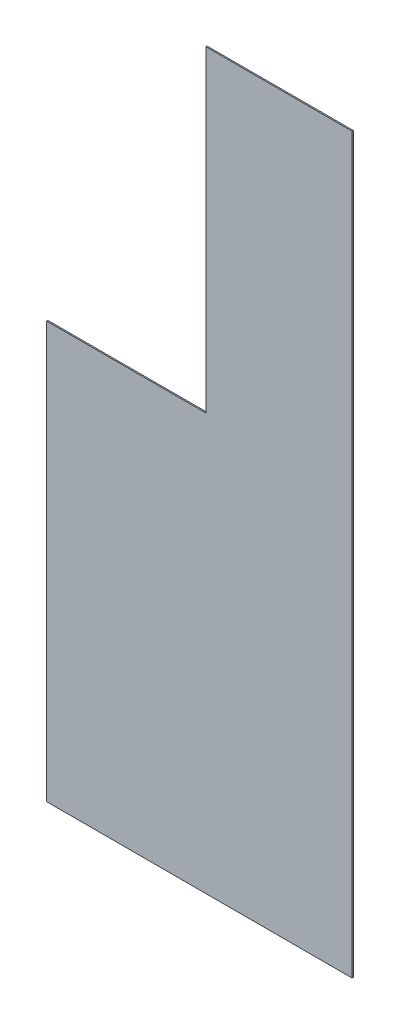
ISO-10303-21;
HEADER;
FILE_DESCRIPTION(('STEP AP214'),'2;1');
FILE_NAME('part.step','',(''),(''),'','','');
FILE_SCHEMA(('AUTOMOTIVE_DESIGN { 1 0 10303 214 1 1 1 1 }'));
ENDSEC;
DATA;
#1=APPLICATION_CONTEXT('core data for automotive mechanical design processes');
#2=APPLICATION_PROTOCOL_DEFINITION('international standard','automotive_design',2000,#1);
#3=PRODUCT_CONTEXT('',#1,'mechanical');
#4=PRODUCT('Part','Part','',(#3));
#5=PRODUCT_RELATED_PRODUCT_CATEGORY('part','',(#4));
#6=PRODUCT_DEFINITION_FORMATION('','',#4);
#7=PRODUCT_DEFINITION_CONTEXT('part definition',#1,'design');
#8=PRODUCT_DEFINITION('design','',#6,#7);
#9=PRODUCT_DEFINITION_SHAPE('','',#8);
#10=(LENGTH_UNIT() NAMED_UNIT(*) SI_UNIT(.MILLI.,.METRE.));
#11=(NAMED_UNIT(*) PLANE_ANGLE_UNIT() SI_UNIT($,.RADIAN.));
#12=(NAMED_UNIT(*) SI_UNIT($,.STERADIAN.) SOLID_ANGLE_UNIT());
#13=UNCERTAINTY_MEASURE_WITH_UNIT(LENGTH_MEASURE(1.E-05),#10,'distance_accuracy_value','');
#14=(GEOMETRIC_REPRESENTATION_CONTEXT(3) GLOBAL_UNCERTAINTY_ASSIGNED_CONTEXT((#13)) GLOBAL_UNIT_ASSIGNED_CONTEXT((#10,
#11,#12)) REPRESENTATION_CONTEXT('',''));
#15=CARTESIAN_POINT('',(0.,0.,0.));
#16=DIRECTION('',(0.,0.,1.));
#17=DIRECTION('',(1.,0.,0.));
#18=AXIS2_PLACEMENT_3D('',#15,#16,#17);
#19=CARTESIAN_POINT('',(2505.,0.,-10.));
#20=DIRECTION('',(0.,-1.,0.));
#21=DIRECTION('',(1.,0.,0.));
#22=AXIS2_PLACEMENT_3D('',#19,#20,#21);
#23=PLANE('',#22);
#24=DIRECTION('',(1.,0.,0.));
#25=VECTOR('',#24,1.);
#26=CARTESIAN_POINT('',(2505.,0.,0.));
#27=LINE('',#26,#25);
#28=CARTESIAN_POINT('',(0.,0.,0.));
#29=VERTEX_POINT('',#28);
#30=CARTESIAN_POINT('',(2505.,0.,0.));
#31=VERTEX_POINT('',#30);
#32=EDGE_CURVE('E123',#29,#31,#27,.T.);
#33=ORIENTED_EDGE('',*,*,#32,.F.);
#34=DIRECTION('',(0.,0.,1.));
#35=VECTOR('',#34,1.);
#36=CARTESIAN_POINT('',(0.,0.,-10.));
#37=LINE('',#36,#35);
#38=CARTESIAN_POINT('',(0.,0.,-10.));
#39=VERTEX_POINT('',#38);
#40=EDGE_CURVE('E11',#39,#29,#37,.T.);
#41=ORIENTED_EDGE('',*,*,#40,.F.);
#42=DIRECTION('',(1.,0.,0.));
#43=VECTOR('',#42,1.);
#44=CARTESIAN_POINT('',(2505.,0.,-10.));
#45=LINE('',#44,#43);
#46=CARTESIAN_POINT('',(2505.,0.,-10.));
#47=VERTEX_POINT('',#46);
#48=EDGE_CURVE('E137',#39,#47,#45,.T.);
#49=ORIENTED_EDGE('',*,*,#48,.T.);
#50=DIRECTION('',(0.,0.,1.));
#51=VECTOR('',#50,1.);
#52=CARTESIAN_POINT('',(2505.,0.,-10.));
#53=LINE('',#52,#51);
#54=EDGE_CURVE('E41',#47,#31,#53,.T.);
#55=ORIENTED_EDGE('',*,*,#54,.T.);
#56=EDGE_LOOP('',(#33,#41,#49,#55));
#57=FACE_BOUND('',#56,.T.);
#58=ADVANCED_FACE('F38',(#57),#23,.T.);
#59=CARTESIAN_POINT('',(0.,0.,-10.));
#60=DIRECTION('',(-1.,0.,0.));
#61=DIRECTION('',(0.,0.,1.));
#62=AXIS2_PLACEMENT_3D('',#59,#60,#61);
#63=PLANE('',#62);
#64=DIRECTION('',(0.,-1.,0.));
#65=VECTOR('',#64,1.);
#66=CARTESIAN_POINT('',(0.,0.,0.));
#67=LINE('',#66,#65);
#68=CARTESIAN_POINT('',(0.,3415.,0.));
#69=VERTEX_POINT('',#68);
#70=EDGE_CURVE('E135',#69,#29,#67,.T.);
#71=ORIENTED_EDGE('',*,*,#70,.F.);
#72=DIRECTION('',(0.,0.,1.));
#73=VECTOR('',#72,1.);
#74=CARTESIAN_POINT('',(0.,3415.,-10.));
#75=LINE('',#74,#73);
#76=CARTESIAN_POINT('',(0.,3415.,-10.));
#77=VERTEX_POINT('',#76);
#78=EDGE_CURVE('E47',#77,#69,#75,.T.);
#79=ORIENTED_EDGE('',*,*,#78,.F.);
#80=DIRECTION('',(0.,-1.,0.));
#81=VECTOR('',#80,1.);
#82=CARTESIAN_POINT('',(0.,0.,-10.));
#83=LINE('',#82,#81);
#84=EDGE_CURVE('E113',#77,#39,#83,.T.);
#85=ORIENTED_EDGE('',*,*,#84,.T.);
#86=ORIENTED_EDGE('',*,*,#40,.T.);
#87=EDGE_LOOP('',(#71,#79,#85,#86));
#88=FACE_BOUND('',#87,.T.);
#89=ADVANCED_FACE('F145',(#88),#63,.T.);
#90=CARTESIAN_POINT('',(0.,3415.,-10.));
#91=DIRECTION('',(0.,1.,0.));
#92=DIRECTION('',(0.,0.,1.));
#93=AXIS2_PLACEMENT_3D('',#90,#91,#92);
#94=PLANE('',#93);
#95=DIRECTION('',(-1.,0.,0.));
#96=VECTOR('',#95,1.);
#97=CARTESIAN_POINT('',(0.,3415.,0.));
#98=LINE('',#97,#96);
#99=CARTESIAN_POINT('',(1305.,3415.,0.));
#100=VERTEX_POINT('',#99);
#101=EDGE_CURVE('E100',#100,#69,#98,.T.);
#102=ORIENTED_EDGE('',*,*,#101,.F.);
#103=DIRECTION('',(0.,0.,1.));
#104=VECTOR('',#103,1.);
#105=CARTESIAN_POINT('',(1305.,3415.,-10.));
#106=LINE('',#105,#104);
#107=CARTESIAN_POINT('',(1305.,3415.,-10.));
#108=VERTEX_POINT('',#107);
#109=EDGE_CURVE('E95',#108,#100,#106,.T.);
#110=ORIENTED_EDGE('',*,*,#109,.F.);
#111=DIRECTION('',(-1.,0.,0.));
#112=VECTOR('',#111,1.);
#113=CARTESIAN_POINT('',(0.,3415.,-10.));
#114=LINE('',#113,#112);
#115=EDGE_CURVE('E98',#108,#77,#114,.T.);
#116=ORIENTED_EDGE('',*,*,#115,.T.);
#117=ORIENTED_EDGE('',*,*,#78,.T.);
#118=EDGE_LOOP('',(#102,#110,#116,#117));
#119=FACE_BOUND('',#118,.T.);
#120=ADVANCED_FACE('F97',(#119),#94,.T.);
#121=CARTESIAN_POINT('',(1305.,3415.,-10.));
#122=DIRECTION('',(-1.,0.,0.));
#123=DIRECTION('',(0.,0.,1.));
#124=AXIS2_PLACEMENT_3D('',#121,#122,#123);
#125=PLANE('',#124);
#126=DIRECTION('',(0.,-1.,0.));
#127=VECTOR('',#126,1.);
#128=CARTESIAN_POINT('',(1305.,3415.,0.));
#129=LINE('',#128,#127);
#130=CARTESIAN_POINT('',(1305.,6017.,0.));
#131=VERTEX_POINT('',#130);
#132=EDGE_CURVE('E132',#131,#100,#129,.T.);
#133=ORIENTED_EDGE('',*,*,#132,.F.);
#134=DIRECTION('',(0.,0.,1.));
#135=VECTOR('',#134,1.);
#136=CARTESIAN_POINT('',(1305.,6017.,-10.));
#137=LINE('',#136,#135);
#138=CARTESIAN_POINT('',(1305.,6017.,-10.));
#139=VERTEX_POINT('',#138);
#140=EDGE_CURVE('E105',#139,#131,#137,.T.);
#141=ORIENTED_EDGE('',*,*,#140,.F.);
#142=DIRECTION('',(0.,-1.,0.));
#143=VECTOR('',#142,1.);
#144=CARTESIAN_POINT('',(1305.,3415.,-10.));
#145=LINE('',#144,#143);
#146=EDGE_CURVE('E111',#139,#108,#145,.T.);
#147=ORIENTED_EDGE('',*,*,#146,.T.);
#148=ORIENTED_EDGE('',*,*,#109,.T.);
#149=EDGE_LOOP('',(#133,#141,#147,#148));
#150=FACE_BOUND('',#149,.T.);
#151=ADVANCED_FACE('F115',(#150),#125,.T.);
#152=CARTESIAN_POINT('',(1305.,6017.,-10.));
#153=DIRECTION('',(0.,1.,0.));
#154=DIRECTION('',(0.,0.,1.));
#155=AXIS2_PLACEMENT_3D('',#152,#153,#154);
#156=PLANE('',#155);
#157=DIRECTION('',(-1.,0.,0.));
#158=VECTOR('',#157,1.);
#159=CARTESIAN_POINT('',(1305.,6017.,0.));
#160=LINE('',#159,#158);
#161=CARTESIAN_POINT('',(2505.,6017.,0.));
#162=VERTEX_POINT('',#161);
#163=EDGE_CURVE('E129',#162,#131,#160,.T.);
#164=ORIENTED_EDGE('',*,*,#163,.F.);
#165=DIRECTION('',(0.,0.,1.));
#166=VECTOR('',#165,1.);
#167=CARTESIAN_POINT('',(2505.,6017.,-10.));
#168=LINE('',#167,#166);
#169=CARTESIAN_POINT('',(2505.,6017.,-10.));
#170=VERTEX_POINT('',#169);
#171=EDGE_CURVE('E140',#170,#162,#168,.T.);
#172=ORIENTED_EDGE('',*,*,#171,.F.);
#173=DIRECTION('',(-1.,0.,0.));
#174=VECTOR('',#173,1.);
#175=CARTESIAN_POINT('',(1305.,6017.,-10.));
#176=LINE('',#175,#174);
#177=EDGE_CURVE('E116',#170,#139,#176,.T.);
#178=ORIENTED_EDGE('',*,*,#177,.T.);
#179=ORIENTED_EDGE('',*,*,#140,.T.);
#180=EDGE_LOOP('',(#164,#172,#178,#179));
#181=FACE_BOUND('',#180,.T.);
#182=ADVANCED_FACE('F158',(#181),#156,.T.);
#183=CARTESIAN_POINT('',(2505.,6017.,-10.));
#184=DIRECTION('',(1.,0.,0.));
#185=DIRECTION('',(0.,1.,0.));
#186=AXIS2_PLACEMENT_3D('',#183,#184,#185);
#187=PLANE('',#186);
#188=DIRECTION('',(0.,1.,0.));
#189=VECTOR('',#188,1.);
#190=CARTESIAN_POINT('',(2505.,6017.,0.));
#191=LINE('',#190,#189);
#192=EDGE_CURVE('E126',#31,#162,#191,.T.);
#193=ORIENTED_EDGE('',*,*,#192,.F.);
#194=ORIENTED_EDGE('',*,*,#54,.F.);
#195=DIRECTION('',(0.,1.,0.));
#196=VECTOR('',#195,1.);
#197=CARTESIAN_POINT('',(2505.,6017.,-10.));
#198=LINE('',#197,#196);
#199=EDGE_CURVE('E118',#47,#170,#198,.T.);
#200=ORIENTED_EDGE('',*,*,#199,.T.);
#201=ORIENTED_EDGE('',*,*,#171,.T.);
#202=EDGE_LOOP('',(#193,#194,#200,#201));
#203=FACE_BOUND('',#202,.T.);
#204=ADVANCED_FACE('F142',(#203),#187,.T.);
#205=CARTESIAN_POINT('',(0.,0.,-10.));
#206=DIRECTION('',(0.,0.,-1.));
#207=DIRECTION('',(-1.,0.,0.));
#208=AXIS2_PLACEMENT_3D('',#205,#206,#207);
#209=PLANE('',#208);
#210=ORIENTED_EDGE('',*,*,#48,.F.);
#211=ORIENTED_EDGE('',*,*,#84,.F.);
#212=ORIENTED_EDGE('',*,*,#115,.F.);
#213=ORIENTED_EDGE('',*,*,#146,.F.);
#214=ORIENTED_EDGE('',*,*,#177,.F.);
#215=ORIENTED_EDGE('',*,*,#199,.F.);
#216=EDGE_LOOP('',(#210,#211,#212,#213,#214,#215));
#217=FACE_BOUND('',#216,.T.);
#218=ADVANCED_FACE('F109',(#217),#209,.T.);
#219=CARTESIAN_POINT('',(0.,0.,0.));
#220=DIRECTION('',(0.,0.,-1.));
#221=DIRECTION('',(-1.,0.,0.));
#222=AXIS2_PLACEMENT_3D('',#219,#220,#221);
#223=PLANE('',#222);
#224=ORIENTED_EDGE('',*,*,#32,.T.);
#225=ORIENTED_EDGE('',*,*,#192,.T.);
#226=ORIENTED_EDGE('',*,*,#163,.T.);
#227=ORIENTED_EDGE('',*,*,#132,.T.);
#228=ORIENTED_EDGE('',*,*,#101,.T.);
#229=ORIENTED_EDGE('',*,*,#70,.T.);
#230=EDGE_LOOP('',(#224,#225,#226,#227,#228,#229));
#231=FACE_BOUND('',#230,.T.);
#232=ADVANCED_FACE('F144',(#231),#223,.F.);
#233=CLOSED_SHELL('',(#58,#89,#120,#151,#182,#204,#218,#232));
#234=MANIFOLD_SOLID_BREP('B2',#233);
#235=ADVANCED_BREP_SHAPE_REPRESENTATION('',(#18,#234),#14);
#236=SHAPE_DEFINITION_REPRESENTATION(#9,#235);
ENDSEC;
END-ISO-10303-21;
